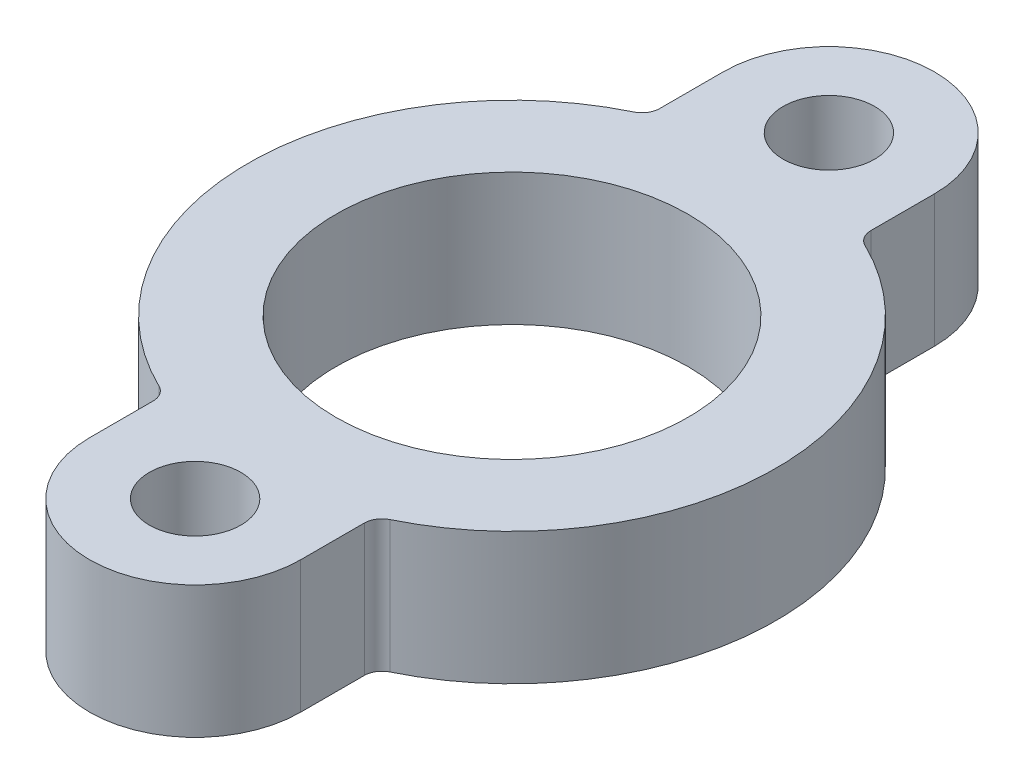
ISO-10303-21;
HEADER;
FILE_DESCRIPTION(('STEP AP214'),'2;1');
FILE_NAME('part.step','',(''),(''),'','','');
FILE_SCHEMA(('AUTOMOTIVE_DESIGN { 1 0 10303 214 1 1 1 1 }'));
ENDSEC;
DATA;
#1=APPLICATION_CONTEXT('core data for automotive mechanical design processes');
#2=APPLICATION_PROTOCOL_DEFINITION('international standard','automotive_design',2000,#1);
#3=PRODUCT_CONTEXT('',#1,'mechanical');
#4=PRODUCT('Part','Part','',(#3));
#5=PRODUCT_RELATED_PRODUCT_CATEGORY('part','',(#4));
#6=PRODUCT_DEFINITION_FORMATION('','',#4);
#7=PRODUCT_DEFINITION_CONTEXT('part definition',#1,'design');
#8=PRODUCT_DEFINITION('design','',#6,#7);
#9=PRODUCT_DEFINITION_SHAPE('','',#8);
#10=(LENGTH_UNIT() NAMED_UNIT(*) SI_UNIT(.MILLI.,.METRE.));
#11=(NAMED_UNIT(*) PLANE_ANGLE_UNIT() SI_UNIT($,.RADIAN.));
#12=(NAMED_UNIT(*) SI_UNIT($,.STERADIAN.) SOLID_ANGLE_UNIT());
#13=UNCERTAINTY_MEASURE_WITH_UNIT(LENGTH_MEASURE(1.E-05),#10,'distance_accuracy_value','');
#14=(GEOMETRIC_REPRESENTATION_CONTEXT(3) GLOBAL_UNCERTAINTY_ASSIGNED_CONTEXT((#13)) GLOBAL_UNIT_ASSIGNED_CONTEXT((#10,
#11,#12)) REPRESENTATION_CONTEXT('',''));
#15=CARTESIAN_POINT('',(0.,0.,0.));
#16=DIRECTION('',(0.,0.,1.));
#17=DIRECTION('',(1.,0.,0.));
#18=AXIS2_PLACEMENT_3D('',#15,#16,#17);
#19=CARTESIAN_POINT('',(0.,9.525,-22.86));
#20=DIRECTION('',(0.,1.,0.));
#21=DIRECTION('',(0.,0.,1.));
#22=AXIS2_PLACEMENT_3D('',#19,#20,#21);
#23=PLANE('',#22);
#24=CARTESIAN_POINT('',(0.,9.525,-22.86));
#25=DIRECTION('',(0.,1.,0.));
#26=DIRECTION('',(0.,0.,1.));
#27=AXIS2_PLACEMENT_3D('',#24,#25,#26);
#28=CIRCLE('',#27,3.302);
#29=CARTESIAN_POINT('',(0.,9.525,-19.558));
#30=VERTEX_POINT('',#29);
#31=EDGE_CURVE('E327',#30,#30,#28,.T.);
#32=ORIENTED_EDGE('',*,*,#31,.F.);
#33=EDGE_LOOP('',(#32));
#34=FACE_BOUND('',#33,.T.);
#35=CARTESIAN_POINT('',(0.,9.525,-22.86));
#36=DIRECTION('',(0.,1.,0.));
#37=DIRECTION('',(0.,0.,1.));
#38=AXIS2_PLACEMENT_3D('',#35,#36,#37);
#39=CIRCLE('',#38,7.62);
#40=CARTESIAN_POINT('',(7.62,9.525,-22.86));
#41=VERTEX_POINT('',#40);
#42=CARTESIAN_POINT('',(-7.62,9.525,-22.86));
#43=VERTEX_POINT('',#42);
#44=EDGE_CURVE('E200',#41,#43,#39,.T.);
#45=ORIENTED_EDGE('',*,*,#44,.T.);
#46=DIRECTION('',(0.,0.,1.));
#47=VECTOR('',#46,1.);
#48=CARTESIAN_POINT('',(-7.62,9.525,-22.86));
#49=LINE('',#48,#47);
#50=CARTESIAN_POINT('',(-7.61999999999999,9.525,-18.2721181038215));
#51=VERTEX_POINT('',#50);
#52=EDGE_CURVE('E112',#43,#51,#49,.T.);
#53=ORIENTED_EDGE('',*,*,#52,.T.);
#54=CARTESIAN_POINT('',(-8.89,9.525,-18.2721181038215));
#55=DIRECTION('',(0.,-1.,0.));
#56=DIRECTION('',(0.,0.,-1.));
#57=AXIS2_PLACEMENT_3D('',#54,#55,#56);
#58=CIRCLE('',#57,1.27);
#59=CARTESIAN_POINT('',(-8.33437499999999,9.525,-17.1301107223326));
#60=VERTEX_POINT('',#59);
#61=EDGE_CURVE('E237',#51,#60,#58,.T.);
#62=ORIENTED_EDGE('',*,*,#61,.T.);
#63=CARTESIAN_POINT('',(0.,9.525,0.));
#64=DIRECTION('',(0.,1.,0.));
#65=DIRECTION('',(0.,0.,1.));
#66=AXIS2_PLACEMENT_3D('',#63,#64,#65);
#67=CIRCLE('',#66,19.05);
#68=CARTESIAN_POINT('',(-8.33437499999999,9.525,17.1301107223326));
#69=VERTEX_POINT('',#68);
#70=EDGE_CURVE('E257',#60,#69,#67,.T.);
#71=ORIENTED_EDGE('',*,*,#70,.T.);
#72=CARTESIAN_POINT('',(-8.88999999999999,9.525,18.2721181038215));
#73=DIRECTION('',(0.,-1.,0.));
#74=DIRECTION('',(0.,0.,1.));
#75=AXIS2_PLACEMENT_3D('',#72,#73,#74);
#76=CIRCLE('',#75,1.27);
#77=CARTESIAN_POINT('',(-7.61999999999999,9.525,18.2721181038215));
#78=VERTEX_POINT('',#77);
#79=EDGE_CURVE('E253',#69,#78,#76,.T.);
#80=ORIENTED_EDGE('',*,*,#79,.T.);
#81=DIRECTION('',(0.,0.,1.));
#82=VECTOR('',#81,1.);
#83=CARTESIAN_POINT('',(-7.61999999999999,9.525,22.86));
#84=LINE('',#83,#82);
#85=CARTESIAN_POINT('',(-7.61999999999999,9.525,22.86));
#86=VERTEX_POINT('',#85);
#87=EDGE_CURVE('E256',#78,#86,#84,.T.);
#88=ORIENTED_EDGE('',*,*,#87,.T.);
#89=CARTESIAN_POINT('',(0.,9.525,22.86));
#90=DIRECTION('',(0.,1.,0.));
#91=DIRECTION('',(0.,0.,1.));
#92=AXIS2_PLACEMENT_3D('',#89,#90,#91);
#93=CIRCLE('',#92,7.61999999999999);
#94=CARTESIAN_POINT('',(7.61999999999999,9.525,22.86));
#95=VERTEX_POINT('',#94);
#96=EDGE_CURVE('E261',#86,#95,#93,.T.);
#97=ORIENTED_EDGE('',*,*,#96,.T.);
#98=DIRECTION('',(0.,0.,-1.));
#99=VECTOR('',#98,1.);
#100=CARTESIAN_POINT('',(7.61999999999999,9.525,22.86));
#101=LINE('',#100,#99);
#102=CARTESIAN_POINT('',(7.62,9.525,18.2721181038215));
#103=VERTEX_POINT('',#102);
#104=EDGE_CURVE('E268',#95,#103,#101,.T.);
#105=ORIENTED_EDGE('',*,*,#104,.T.);
#106=CARTESIAN_POINT('',(8.89,9.525,18.2721181038215));
#107=DIRECTION('',(0.,-1.,0.));
#108=DIRECTION('',(0.,0.,-1.));
#109=AXIS2_PLACEMENT_3D('',#106,#107,#108);
#110=CIRCLE('',#109,1.27);
#111=CARTESIAN_POINT('',(8.334375,9.525,17.1301107223326));
#112=VERTEX_POINT('',#111);
#113=EDGE_CURVE('E143',#103,#112,#110,.T.);
#114=ORIENTED_EDGE('',*,*,#113,.T.);
#115=CARTESIAN_POINT('',(0.,9.525,0.));
#116=DIRECTION('',(0.,1.,0.));
#117=DIRECTION('',(0.,0.,1.));
#118=AXIS2_PLACEMENT_3D('',#115,#116,#117);
#119=CIRCLE('',#118,19.05);
#120=CARTESIAN_POINT('',(8.334375,9.525,-17.1301107223326));
#121=VERTEX_POINT('',#120);
#122=EDGE_CURVE('E137',#112,#121,#119,.T.);
#123=ORIENTED_EDGE('',*,*,#122,.T.);
#124=CARTESIAN_POINT('',(8.89,9.525,-18.2721181038215));
#125=DIRECTION('',(0.,-1.,0.));
#126=DIRECTION('',(0.,0.,1.));
#127=AXIS2_PLACEMENT_3D('',#124,#125,#126);
#128=CIRCLE('',#127,1.27);
#129=CARTESIAN_POINT('',(7.62000000000001,9.525,-18.2721181038215));
#130=VERTEX_POINT('',#129);
#131=EDGE_CURVE('E141',#121,#130,#128,.T.);
#132=ORIENTED_EDGE('',*,*,#131,.T.);
#133=DIRECTION('',(0.,0.,-1.));
#134=VECTOR('',#133,1.);
#135=CARTESIAN_POINT('',(7.62,9.525,-22.86));
#136=LINE('',#135,#134);
#137=EDGE_CURVE('E57',#130,#41,#136,.T.);
#138=ORIENTED_EDGE('',*,*,#137,.T.);
#139=EDGE_LOOP('',(#45,#53,#62,#71,#80,#88,#97,#105,#114,#123,#132,#138));
#140=FACE_BOUND('',#139,.T.);
#141=CARTESIAN_POINT('',(0.,9.525,0.));
#142=DIRECTION('',(0.,1.,0.));
#143=DIRECTION('',(0.,0.,1.));
#144=AXIS2_PLACEMENT_3D('',#141,#142,#143);
#145=CIRCLE('',#144,12.7);
#146=CARTESIAN_POINT('',(0.,9.525,12.7));
#147=VERTEX_POINT('',#146);
#148=EDGE_CURVE('E170',#147,#147,#145,.T.);
#149=ORIENTED_EDGE('',*,*,#148,.F.);
#150=EDGE_LOOP('',(#149));
#151=FACE_BOUND('',#150,.T.);
#152=CARTESIAN_POINT('',(0.,9.525,22.86));
#153=DIRECTION('',(0.,1.,0.));
#154=DIRECTION('',(0.,0.,1.));
#155=AXIS2_PLACEMENT_3D('',#152,#153,#154);
#156=CIRCLE('',#155,3.302);
#157=CARTESIAN_POINT('',(0.,9.525,26.162));
#158=VERTEX_POINT('',#157);
#159=EDGE_CURVE('E316',#158,#158,#156,.T.);
#160=ORIENTED_EDGE('',*,*,#159,.F.);
#161=EDGE_LOOP('',(#160));
#162=FACE_BOUND('',#161,.T.);
#163=ADVANCED_FACE('F39',(#34,#140,#151,#162),#23,.T.);
#164=CARTESIAN_POINT('',(0.,0.,-22.86));
#165=DIRECTION('',(0.,1.,0.));
#166=DIRECTION('',(0.,0.,1.));
#167=AXIS2_PLACEMENT_3D('',#164,#165,#166);
#168=PLANE('',#167);
#169=CARTESIAN_POINT('',(0.,0.,-22.86));
#170=DIRECTION('',(0.,1.,0.));
#171=DIRECTION('',(0.,0.,1.));
#172=AXIS2_PLACEMENT_3D('',#169,#170,#171);
#173=CIRCLE('',#172,7.62);
#174=CARTESIAN_POINT('',(7.62,0.,-22.86));
#175=VERTEX_POINT('',#174);
#176=CARTESIAN_POINT('',(-7.62,0.,-22.86));
#177=VERTEX_POINT('',#176);
#178=EDGE_CURVE('E165',#175,#177,#173,.T.);
#179=ORIENTED_EDGE('',*,*,#178,.F.);
#180=DIRECTION('',(0.,0.,-1.));
#181=VECTOR('',#180,1.);
#182=CARTESIAN_POINT('',(7.62,0.,-22.86));
#183=LINE('',#182,#181);
#184=CARTESIAN_POINT('',(7.62000000000001,0.,-18.2721181038215));
#185=VERTEX_POINT('',#184);
#186=EDGE_CURVE('E104',#185,#175,#183,.T.);
#187=ORIENTED_EDGE('',*,*,#186,.F.);
#188=CARTESIAN_POINT('',(8.89,0.,-18.2721181038215));
#189=DIRECTION('',(0.,-1.,0.));
#190=DIRECTION('',(0.,0.,1.));
#191=AXIS2_PLACEMENT_3D('',#188,#189,#190);
#192=CIRCLE('',#191,1.27);
#193=CARTESIAN_POINT('',(8.334375,0.,-17.1301107223326));
#194=VERTEX_POINT('',#193);
#195=EDGE_CURVE('E98',#194,#185,#192,.T.);
#196=ORIENTED_EDGE('',*,*,#195,.F.);
#197=CARTESIAN_POINT('',(0.,0.,0.));
#198=DIRECTION('',(0.,1.,0.));
#199=DIRECTION('',(0.,0.,1.));
#200=AXIS2_PLACEMENT_3D('',#197,#198,#199);
#201=CIRCLE('',#200,19.05);
#202=CARTESIAN_POINT('',(8.334375,0.,17.1301107223326));
#203=VERTEX_POINT('',#202);
#204=EDGE_CURVE('E152',#203,#194,#201,.T.);
#205=ORIENTED_EDGE('',*,*,#204,.F.);
#206=CARTESIAN_POINT('',(8.89,0.,18.2721181038215));
#207=DIRECTION('',(0.,-1.,0.));
#208=DIRECTION('',(0.,0.,-1.));
#209=AXIS2_PLACEMENT_3D('',#206,#207,#208);
#210=CIRCLE('',#209,1.27);
#211=CARTESIAN_POINT('',(7.62,0.,18.2721181038215));
#212=VERTEX_POINT('',#211);
#213=EDGE_CURVE('E191',#212,#203,#210,.T.);
#214=ORIENTED_EDGE('',*,*,#213,.F.);
#215=DIRECTION('',(0.,0.,-1.));
#216=VECTOR('',#215,1.);
#217=CARTESIAN_POINT('',(7.61999999999999,0.,22.86));
#218=LINE('',#217,#216);
#219=CARTESIAN_POINT('',(7.61999999999999,0.,22.86));
#220=VERTEX_POINT('',#219);
#221=EDGE_CURVE('E188',#220,#212,#218,.T.);
#222=ORIENTED_EDGE('',*,*,#221,.F.);
#223=CARTESIAN_POINT('',(0.,0.,22.86));
#224=DIRECTION('',(0.,1.,0.));
#225=DIRECTION('',(0.,0.,1.));
#226=AXIS2_PLACEMENT_3D('',#223,#224,#225);
#227=CIRCLE('',#226,7.61999999999999);
#228=CARTESIAN_POINT('',(-7.61999999999999,0.,22.86));
#229=VERTEX_POINT('',#228);
#230=EDGE_CURVE('E185',#229,#220,#227,.T.);
#231=ORIENTED_EDGE('',*,*,#230,.F.);
#232=DIRECTION('',(0.,0.,1.));
#233=VECTOR('',#232,1.);
#234=CARTESIAN_POINT('',(-7.61999999999999,0.,22.86));
#235=LINE('',#234,#233);
#236=CARTESIAN_POINT('',(-7.61999999999999,0.,18.2721181038215));
#237=VERTEX_POINT('',#236);
#238=EDGE_CURVE('E182',#237,#229,#235,.T.);
#239=ORIENTED_EDGE('',*,*,#238,.F.);
#240=CARTESIAN_POINT('',(-8.88999999999999,0.,18.2721181038215));
#241=DIRECTION('',(0.,-1.,0.));
#242=DIRECTION('',(0.,0.,1.));
#243=AXIS2_PLACEMENT_3D('',#240,#241,#242);
#244=CIRCLE('',#243,1.27);
#245=CARTESIAN_POINT('',(-8.33437499999999,0.,17.1301107223326));
#246=VERTEX_POINT('',#245);
#247=EDGE_CURVE('E179',#246,#237,#244,.T.);
#248=ORIENTED_EDGE('',*,*,#247,.F.);
#249=CARTESIAN_POINT('',(0.,0.,0.));
#250=DIRECTION('',(0.,1.,0.));
#251=DIRECTION('',(0.,0.,1.));
#252=AXIS2_PLACEMENT_3D('',#249,#250,#251);
#253=CIRCLE('',#252,19.05);
#254=CARTESIAN_POINT('',(-8.33437499999999,0.,-17.1301107223326));
#255=VERTEX_POINT('',#254);
#256=EDGE_CURVE('E176',#255,#246,#253,.T.);
#257=ORIENTED_EDGE('',*,*,#256,.F.);
#258=CARTESIAN_POINT('',(-8.89,0.,-18.2721181038215));
#259=DIRECTION('',(0.,-1.,0.));
#260=DIRECTION('',(0.,0.,-1.));
#261=AXIS2_PLACEMENT_3D('',#258,#259,#260);
#262=CIRCLE('',#261,1.27);
#263=CARTESIAN_POINT('',(-7.61999999999999,0.,-18.2721181038215));
#264=VERTEX_POINT('',#263);
#265=EDGE_CURVE('E173',#264,#255,#262,.T.);
#266=ORIENTED_EDGE('',*,*,#265,.F.);
#267=DIRECTION('',(0.,0.,1.));
#268=VECTOR('',#267,1.);
#269=CARTESIAN_POINT('',(-7.62,0.,-22.86));
#270=LINE('',#269,#268);
#271=EDGE_CURVE('E169',#177,#264,#270,.T.);
#272=ORIENTED_EDGE('',*,*,#271,.F.);
#273=EDGE_LOOP('',(#179,#187,#196,#205,#214,#222,#231,#239,#248,#257,#266,#272));
#274=FACE_BOUND('',#273,.T.);
#275=CARTESIAN_POINT('',(0.,0.,0.));
#276=DIRECTION('',(0.,1.,0.));
#277=DIRECTION('',(0.,0.,1.));
#278=AXIS2_PLACEMENT_3D('',#275,#276,#277);
#279=CIRCLE('',#278,12.7);
#280=CARTESIAN_POINT('',(0.,0.,12.7));
#281=VERTEX_POINT('',#280);
#282=EDGE_CURVE('E331',#281,#281,#279,.T.);
#283=ORIENTED_EDGE('',*,*,#282,.T.);
#284=EDGE_LOOP('',(#283));
#285=FACE_BOUND('',#284,.T.);
#286=CARTESIAN_POINT('',(0.,0.,-22.86));
#287=DIRECTION('',(0.,1.,0.));
#288=DIRECTION('',(0.,0.,1.));
#289=AXIS2_PLACEMENT_3D('',#286,#287,#288);
#290=CIRCLE('',#289,3.302);
#291=CARTESIAN_POINT('',(0.,0.,-19.558));
#292=VERTEX_POINT('',#291);
#293=EDGE_CURVE('E324',#292,#292,#290,.T.);
#294=ORIENTED_EDGE('',*,*,#293,.T.);
#295=EDGE_LOOP('',(#294));
#296=FACE_BOUND('',#295,.T.);
#297=CARTESIAN_POINT('',(0.,0.,22.86));
#298=DIRECTION('',(0.,1.,0.));
#299=DIRECTION('',(0.,0.,1.));
#300=AXIS2_PLACEMENT_3D('',#297,#298,#299);
#301=CIRCLE('',#300,3.302);
#302=CARTESIAN_POINT('',(0.,0.,26.162));
#303=VERTEX_POINT('',#302);
#304=EDGE_CURVE('E319',#303,#303,#301,.T.);
#305=ORIENTED_EDGE('',*,*,#304,.T.);
#306=EDGE_LOOP('',(#305));
#307=FACE_BOUND('',#306,.T.);
#308=ADVANCED_FACE('F241',(#274,#285,#296,#307),#168,.F.);
#309=CARTESIAN_POINT('',(0.,9.525,-22.86));
#310=DIRECTION('',(0.,-1.,0.));
#311=DIRECTION('',(0.,0.,-1.));
#312=AXIS2_PLACEMENT_3D('',#309,#310,#311);
#313=CYLINDRICAL_SURFACE('',#312,7.62);
#314=ORIENTED_EDGE('',*,*,#178,.T.);
#315=DIRECTION('',(0.,-1.,0.));
#316=VECTOR('',#315,1.);
#317=CARTESIAN_POINT('',(-7.62,9.525,-22.86));
#318=LINE('',#317,#316);
#319=EDGE_CURVE('E11',#43,#177,#318,.T.);
#320=ORIENTED_EDGE('',*,*,#319,.F.);
#321=ORIENTED_EDGE('',*,*,#44,.F.);
#322=DIRECTION('',(0.,-1.,0.));
#323=VECTOR('',#322,1.);
#324=CARTESIAN_POINT('',(7.62,9.525,-22.86));
#325=LINE('',#324,#323);
#326=EDGE_CURVE('E161',#41,#175,#325,.T.);
#327=ORIENTED_EDGE('',*,*,#326,.T.);
#328=EDGE_LOOP('',(#314,#320,#321,#327));
#329=FACE_BOUND('',#328,.T.);
#330=ADVANCED_FACE('F41',(#329),#313,.T.);
#331=CARTESIAN_POINT('',(-7.62,9.525,-22.86));
#332=DIRECTION('',(1.,0.,0.));
#333=DIRECTION('',(0.,0.,-1.));
#334=AXIS2_PLACEMENT_3D('',#331,#332,#333);
#335=PLANE('',#334);
#336=ORIENTED_EDGE('',*,*,#271,.T.);
#337=DIRECTION('',(0.,-1.,0.));
#338=VECTOR('',#337,1.);
#339=CARTESIAN_POINT('',(-7.61999999999999,9.525,-18.2721181038215));
#340=LINE('',#339,#338);
#341=EDGE_CURVE('E49',#51,#264,#340,.T.);
#342=ORIENTED_EDGE('',*,*,#341,.F.);
#343=ORIENTED_EDGE('',*,*,#52,.F.);
#344=ORIENTED_EDGE('',*,*,#319,.T.);
#345=EDGE_LOOP('',(#336,#342,#343,#344));
#346=FACE_BOUND('',#345,.T.);
#347=ADVANCED_FACE('F439',(#346),#335,.F.);
#348=CARTESIAN_POINT('',(-8.89,9.525,-18.2721181038215));
#349=DIRECTION('',(0.,-1.,0.));
#350=DIRECTION('',(0.,0.,-1.));
#351=AXIS2_PLACEMENT_3D('',#348,#349,#350);
#352=CYLINDRICAL_SURFACE('',#351,1.27);
#353=ORIENTED_EDGE('',*,*,#265,.T.);
#354=DIRECTION('',(0.,-1.,0.));
#355=VECTOR('',#354,1.);
#356=CARTESIAN_POINT('',(-8.33437499999999,9.525,-17.1301107223326));
#357=LINE('',#356,#355);
#358=EDGE_CURVE('E227',#60,#255,#357,.T.);
#359=ORIENTED_EDGE('',*,*,#358,.F.);
#360=ORIENTED_EDGE('',*,*,#61,.F.);
#361=ORIENTED_EDGE('',*,*,#341,.T.);
#362=EDGE_LOOP('',(#353,#359,#360,#361));
#363=FACE_BOUND('',#362,.T.);
#364=ADVANCED_FACE('F235',(#363),#352,.F.);
#365=CARTESIAN_POINT('',(0.,9.525,0.));
#366=DIRECTION('',(0.,-1.,0.));
#367=DIRECTION('',(0.,0.,-1.));
#368=AXIS2_PLACEMENT_3D('',#365,#366,#367);
#369=CYLINDRICAL_SURFACE('',#368,19.05);
#370=ORIENTED_EDGE('',*,*,#256,.T.);
#371=DIRECTION('',(0.,-1.,0.));
#372=VECTOR('',#371,1.);
#373=CARTESIAN_POINT('',(-8.33437499999999,9.525,17.1301107223326));
#374=LINE('',#373,#372);
#375=EDGE_CURVE('E223',#69,#246,#374,.T.);
#376=ORIENTED_EDGE('',*,*,#375,.F.);
#377=ORIENTED_EDGE('',*,*,#70,.F.);
#378=ORIENTED_EDGE('',*,*,#358,.T.);
#379=EDGE_LOOP('',(#370,#376,#377,#378));
#380=FACE_BOUND('',#379,.T.);
#381=ADVANCED_FACE('F247',(#380),#369,.T.);
#382=CARTESIAN_POINT('',(-8.88999999999999,9.525,18.2721181038215));
#383=DIRECTION('',(0.,-1.,0.));
#384=DIRECTION('',(0.,0.,-1.));
#385=AXIS2_PLACEMENT_3D('',#382,#383,#384);
#386=CYLINDRICAL_SURFACE('',#385,1.27);
#387=ORIENTED_EDGE('',*,*,#247,.T.);
#388=DIRECTION('',(0.,-1.,0.));
#389=VECTOR('',#388,1.);
#390=CARTESIAN_POINT('',(-7.61999999999999,9.525,18.2721181038215));
#391=LINE('',#390,#389);
#392=EDGE_CURVE('E219',#78,#237,#391,.T.);
#393=ORIENTED_EDGE('',*,*,#392,.F.);
#394=ORIENTED_EDGE('',*,*,#79,.F.);
#395=ORIENTED_EDGE('',*,*,#375,.T.);
#396=EDGE_LOOP('',(#387,#393,#394,#395));
#397=FACE_BOUND('',#396,.T.);
#398=ADVANCED_FACE('F251',(#397),#386,.F.);
#399=CARTESIAN_POINT('',(-7.61999999999999,9.525,22.86));
#400=DIRECTION('',(1.,0.,0.));
#401=DIRECTION('',(0.,0.,-1.));
#402=AXIS2_PLACEMENT_3D('',#399,#400,#401);
#403=PLANE('',#402);
#404=ORIENTED_EDGE('',*,*,#238,.T.);
#405=DIRECTION('',(0.,-1.,0.));
#406=VECTOR('',#405,1.);
#407=CARTESIAN_POINT('',(-7.61999999999999,9.525,22.86));
#408=LINE('',#407,#406);
#409=EDGE_CURVE('E215',#86,#229,#408,.T.);
#410=ORIENTED_EDGE('',*,*,#409,.F.);
#411=ORIENTED_EDGE('',*,*,#87,.F.);
#412=ORIENTED_EDGE('',*,*,#392,.T.);
#413=EDGE_LOOP('',(#404,#410,#411,#412));
#414=FACE_BOUND('',#413,.T.);
#415=ADVANCED_FACE('F404',(#414),#403,.F.);
#416=CARTESIAN_POINT('',(0.,9.525,22.86));
#417=DIRECTION('',(0.,-1.,0.));
#418=DIRECTION('',(0.,0.,-1.));
#419=AXIS2_PLACEMENT_3D('',#416,#417,#418);
#420=CYLINDRICAL_SURFACE('',#419,7.61999999999999);
#421=ORIENTED_EDGE('',*,*,#230,.T.);
#422=DIRECTION('',(0.,-1.,0.));
#423=VECTOR('',#422,1.);
#424=CARTESIAN_POINT('',(7.61999999999999,9.525,22.86));
#425=LINE('',#424,#423);
#426=EDGE_CURVE('E211',#95,#220,#425,.T.);
#427=ORIENTED_EDGE('',*,*,#426,.F.);
#428=ORIENTED_EDGE('',*,*,#96,.F.);
#429=ORIENTED_EDGE('',*,*,#409,.T.);
#430=EDGE_LOOP('',(#421,#427,#428,#429));
#431=FACE_BOUND('',#430,.T.);
#432=ADVANCED_FACE('F395',(#431),#420,.T.);
#433=CARTESIAN_POINT('',(7.61999999999999,9.525,22.86));
#434=DIRECTION('',(-1.,0.,0.));
#435=DIRECTION('',(0.,0.,1.));
#436=AXIS2_PLACEMENT_3D('',#433,#434,#435);
#437=PLANE('',#436);
#438=ORIENTED_EDGE('',*,*,#221,.T.);
#439=DIRECTION('',(0.,-1.,0.));
#440=VECTOR('',#439,1.);
#441=CARTESIAN_POINT('',(7.62,9.525,18.2721181038215));
#442=LINE('',#441,#440);
#443=EDGE_CURVE('E207',#103,#212,#442,.T.);
#444=ORIENTED_EDGE('',*,*,#443,.F.);
#445=ORIENTED_EDGE('',*,*,#104,.F.);
#446=ORIENTED_EDGE('',*,*,#426,.T.);
#447=EDGE_LOOP('',(#438,#444,#445,#446));
#448=FACE_BOUND('',#447,.T.);
#449=ADVANCED_FACE('F276',(#448),#437,.F.);
#450=CARTESIAN_POINT('',(8.89,9.525,18.2721181038215));
#451=DIRECTION('',(0.,-1.,0.));
#452=DIRECTION('',(0.,0.,-1.));
#453=AXIS2_PLACEMENT_3D('',#450,#451,#452);
#454=CYLINDRICAL_SURFACE('',#453,1.27);
#455=ORIENTED_EDGE('',*,*,#213,.T.);
#456=DIRECTION('',(0.,-1.,0.));
#457=VECTOR('',#456,1.);
#458=CARTESIAN_POINT('',(8.334375,9.525,17.1301107223326));
#459=LINE('',#458,#457);
#460=EDGE_CURVE('E154',#112,#203,#459,.T.);
#461=ORIENTED_EDGE('',*,*,#460,.F.);
#462=ORIENTED_EDGE('',*,*,#113,.F.);
#463=ORIENTED_EDGE('',*,*,#443,.T.);
#464=EDGE_LOOP('',(#455,#461,#462,#463));
#465=FACE_BOUND('',#464,.T.);
#466=ADVANCED_FACE('F280',(#465),#454,.F.);
#467=CARTESIAN_POINT('',(0.,9.525,0.));
#468=DIRECTION('',(0.,-1.,0.));
#469=DIRECTION('',(0.,0.,-1.));
#470=AXIS2_PLACEMENT_3D('',#467,#468,#469);
#471=CYLINDRICAL_SURFACE('',#470,19.05);
#472=ORIENTED_EDGE('',*,*,#204,.T.);
#473=DIRECTION('',(0.,-1.,0.));
#474=VECTOR('',#473,1.);
#475=CARTESIAN_POINT('',(8.334375,9.525,-17.1301107223326));
#476=LINE('',#475,#474);
#477=EDGE_CURVE('E149',#121,#194,#476,.T.);
#478=ORIENTED_EDGE('',*,*,#477,.F.);
#479=ORIENTED_EDGE('',*,*,#122,.F.);
#480=ORIENTED_EDGE('',*,*,#460,.T.);
#481=EDGE_LOOP('',(#472,#478,#479,#480));
#482=FACE_BOUND('',#481,.T.);
#483=ADVANCED_FACE('F150',(#482),#471,.T.);
#484=CARTESIAN_POINT('',(8.89,9.525,-18.2721181038215));
#485=DIRECTION('',(0.,-1.,0.));
#486=DIRECTION('',(0.,0.,-1.));
#487=AXIS2_PLACEMENT_3D('',#484,#485,#486);
#488=CYLINDRICAL_SURFACE('',#487,1.27);
#489=ORIENTED_EDGE('',*,*,#195,.T.);
#490=DIRECTION('',(0.,-1.,0.));
#491=VECTOR('',#490,1.);
#492=CARTESIAN_POINT('',(7.62000000000001,9.525,-18.2721181038215));
#493=LINE('',#492,#491);
#494=EDGE_CURVE('E155',#130,#185,#493,.T.);
#495=ORIENTED_EDGE('',*,*,#494,.F.);
#496=ORIENTED_EDGE('',*,*,#131,.F.);
#497=ORIENTED_EDGE('',*,*,#477,.T.);
#498=EDGE_LOOP('',(#489,#495,#496,#497));
#499=FACE_BOUND('',#498,.T.);
#500=ADVANCED_FACE('F157',(#499),#488,.F.);
#501=CARTESIAN_POINT('',(7.62,9.525,-22.86));
#502=DIRECTION('',(-1.,0.,0.));
#503=DIRECTION('',(0.,0.,1.));
#504=AXIS2_PLACEMENT_3D('',#501,#502,#503);
#505=PLANE('',#504);
#506=ORIENTED_EDGE('',*,*,#186,.T.);
#507=ORIENTED_EDGE('',*,*,#326,.F.);
#508=ORIENTED_EDGE('',*,*,#137,.F.);
#509=ORIENTED_EDGE('',*,*,#494,.T.);
#510=EDGE_LOOP('',(#506,#507,#508,#509));
#511=FACE_BOUND('',#510,.T.);
#512=ADVANCED_FACE('F284',(#511),#505,.F.);
#513=CARTESIAN_POINT('',(0.,9.525,0.));
#514=DIRECTION('',(0.,-1.,0.));
#515=DIRECTION('',(0.,0.,-1.));
#516=AXIS2_PLACEMENT_3D('',#513,#514,#515);
#517=CYLINDRICAL_SURFACE('',#516,12.7);
#518=ORIENTED_EDGE('',*,*,#148,.T.);
#519=EDGE_LOOP('',(#518));
#520=FACE_BOUND('',#519,.T.);
#521=ORIENTED_EDGE('',*,*,#282,.F.);
#522=EDGE_LOOP('',(#521));
#523=FACE_BOUND('',#522,.T.);
#524=ADVANCED_FACE('F286',(#520,#523),#517,.F.);
#525=CARTESIAN_POINT('',(0.,9.525,-22.86));
#526=DIRECTION('',(0.,-1.,0.));
#527=DIRECTION('',(0.,0.,-1.));
#528=AXIS2_PLACEMENT_3D('',#525,#526,#527);
#529=CYLINDRICAL_SURFACE('',#528,3.302);
#530=ORIENTED_EDGE('',*,*,#31,.T.);
#531=EDGE_LOOP('',(#530));
#532=FACE_BOUND('',#531,.T.);
#533=ORIENTED_EDGE('',*,*,#293,.F.);
#534=EDGE_LOOP('',(#533));
#535=FACE_BOUND('',#534,.T.);
#536=ADVANCED_FACE('F292',(#532,#535),#529,.F.);
#537=CARTESIAN_POINT('',(0.,9.525,22.86));
#538=DIRECTION('',(0.,-1.,0.));
#539=DIRECTION('',(0.,0.,-1.));
#540=AXIS2_PLACEMENT_3D('',#537,#538,#539);
#541=CYLINDRICAL_SURFACE('',#540,3.302);
#542=ORIENTED_EDGE('',*,*,#159,.T.);
#543=EDGE_LOOP('',(#542));
#544=FACE_BOUND('',#543,.T.);
#545=ORIENTED_EDGE('',*,*,#304,.F.);
#546=EDGE_LOOP('',(#545));
#547=FACE_BOUND('',#546,.T.);
#548=ADVANCED_FACE('F307',(#544,#547),#541,.F.);
#549=CLOSED_SHELL('',(#163,#308,#330,#347,#364,#381,#398,#415,#432,#449,#466,#483,#500,#512,
#524,#536,#548));
#550=MANIFOLD_SOLID_BREP('B2',#549);
#551=ADVANCED_BREP_SHAPE_REPRESENTATION('',(#18,#550),#14);
#552=SHAPE_DEFINITION_REPRESENTATION(#9,#551);
ENDSEC;
END-ISO-10303-21;
